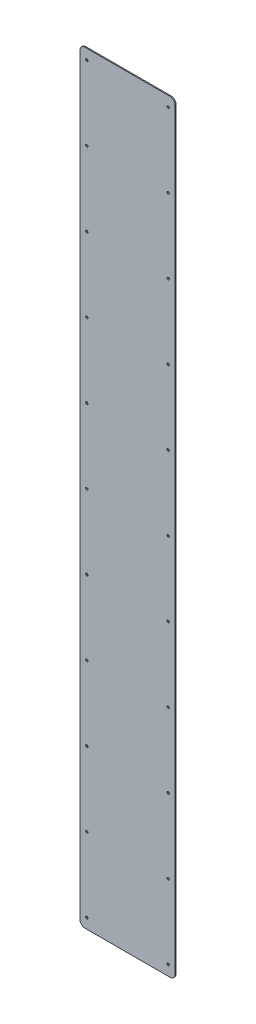
ISO-10303-21;
HEADER;
FILE_DESCRIPTION(('STEP AP214'),'2;1');
FILE_NAME('part.step','',(''),(''),'','','');
FILE_SCHEMA(('AUTOMOTIVE_DESIGN { 1 0 10303 214 1 1 1 1 }'));
ENDSEC;
DATA;
#1=APPLICATION_CONTEXT('core data for automotive mechanical design processes');
#2=APPLICATION_PROTOCOL_DEFINITION('international standard','automotive_design',2000,#1);
#3=PRODUCT_CONTEXT('',#1,'mechanical');
#4=PRODUCT('Part','Part','',(#3));
#5=PRODUCT_RELATED_PRODUCT_CATEGORY('part','',(#4));
#6=PRODUCT_DEFINITION_FORMATION('','',#4);
#7=PRODUCT_DEFINITION_CONTEXT('part definition',#1,'design');
#8=PRODUCT_DEFINITION('design','',#6,#7);
#9=PRODUCT_DEFINITION_SHAPE('','',#8);
#10=(LENGTH_UNIT() NAMED_UNIT(*) SI_UNIT(.MILLI.,.METRE.));
#11=(NAMED_UNIT(*) PLANE_ANGLE_UNIT() SI_UNIT($,.RADIAN.));
#12=(NAMED_UNIT(*) SI_UNIT($,.STERADIAN.) SOLID_ANGLE_UNIT());
#13=UNCERTAINTY_MEASURE_WITH_UNIT(LENGTH_MEASURE(1.E-05),#10,'distance_accuracy_value','');
#14=(GEOMETRIC_REPRESENTATION_CONTEXT(3) GLOBAL_UNCERTAINTY_ASSIGNED_CONTEXT((#13)) GLOBAL_UNIT_ASSIGNED_CONTEXT((#10,
#11,#12)) REPRESENTATION_CONTEXT('',''));
#15=CARTESIAN_POINT('',(0.,0.,0.));
#16=DIRECTION('',(0.,0.,1.));
#17=DIRECTION('',(1.,0.,0.));
#18=AXIS2_PLACEMENT_3D('',#15,#16,#17);
#19=CARTESIAN_POINT('',(10.,10.,-2.));
#20=DIRECTION('',(0.,0.,1.));
#21=DIRECTION('',(1.,0.,0.));
#22=AXIS2_PLACEMENT_3D('',#19,#20,#21);
#23=CYLINDRICAL_SURFACE('',#22,10.);
#24=CARTESIAN_POINT('',(10.,10.,0.));
#25=DIRECTION('',(0.,0.,1.));
#26=DIRECTION('',(1.,0.,0.));
#27=AXIS2_PLACEMENT_3D('',#24,#25,#26);
#28=CIRCLE('',#27,10.);
#29=CARTESIAN_POINT('',(0.,10.0000000000001,0.));
#30=VERTEX_POINT('',#29);
#31=CARTESIAN_POINT('',(10.0000000000001,0.,0.));
#32=VERTEX_POINT('',#31);
#33=EDGE_CURVE('E133',#30,#32,#28,.T.);
#34=ORIENTED_EDGE('',*,*,#33,.F.);
#35=DIRECTION('',(0.,0.,1.));
#36=VECTOR('',#35,1.);
#37=CARTESIAN_POINT('',(0.,10.0000000000001,-2.));
#38=LINE('',#37,#36);
#39=CARTESIAN_POINT('',(0.,10.0000000000001,-2.));
#40=VERTEX_POINT('',#39);
#41=EDGE_CURVE('E11',#40,#30,#38,.T.);
#42=ORIENTED_EDGE('',*,*,#41,.F.);
#43=CARTESIAN_POINT('',(10.,10.,-2.));
#44=DIRECTION('',(0.,0.,1.));
#45=DIRECTION('',(1.,0.,0.));
#46=AXIS2_PLACEMENT_3D('',#43,#44,#45);
#47=CIRCLE('',#46,10.);
#48=CARTESIAN_POINT('',(10.0000000000001,0.,-2.));
#49=VERTEX_POINT('',#48);
#50=EDGE_CURVE('E154',#40,#49,#47,.T.);
#51=ORIENTED_EDGE('',*,*,#50,.T.);
#52=DIRECTION('',(0.,0.,1.));
#53=VECTOR('',#52,1.);
#54=CARTESIAN_POINT('',(10.0000000000001,0.,-2.));
#55=LINE('',#54,#53);
#56=EDGE_CURVE('E39',#49,#32,#55,.T.);
#57=ORIENTED_EDGE('',*,*,#56,.T.);
#58=EDGE_LOOP('',(#34,#42,#51,#57));
#59=FACE_BOUND('',#58,.T.);
#60=ADVANCED_FACE('F36',(#59),#23,.T.);
#61=CARTESIAN_POINT('',(0.,10.0000000000001,-2.));
#62=DIRECTION('',(-1.,0.,0.));
#63=DIRECTION('',(0.,0.,1.));
#64=AXIS2_PLACEMENT_3D('',#61,#62,#63);
#65=PLANE('',#64);
#66=DIRECTION('',(0.,-1.,0.));
#67=VECTOR('',#66,1.);
#68=CARTESIAN_POINT('',(0.,10.0000000000001,0.));
#69=LINE('',#68,#67);
#70=CARTESIAN_POINT('',(0.,1490.,0.));
#71=VERTEX_POINT('',#70);
#72=EDGE_CURVE('E152',#71,#30,#69,.T.);
#73=ORIENTED_EDGE('',*,*,#72,.F.);
#74=DIRECTION('',(0.,0.,1.));
#75=VECTOR('',#74,1.);
#76=CARTESIAN_POINT('',(0.,1490.,-2.));
#77=LINE('',#76,#75);
#78=CARTESIAN_POINT('',(0.,1490.,-2.));
#79=VERTEX_POINT('',#78);
#80=EDGE_CURVE('E45',#79,#71,#77,.T.);
#81=ORIENTED_EDGE('',*,*,#80,.F.);
#82=DIRECTION('',(0.,-1.,0.));
#83=VECTOR('',#82,1.);
#84=CARTESIAN_POINT('',(0.,10.0000000000001,-2.));
#85=LINE('',#84,#83);
#86=EDGE_CURVE('E123',#79,#40,#85,.T.);
#87=ORIENTED_EDGE('',*,*,#86,.T.);
#88=ORIENTED_EDGE('',*,*,#41,.T.);
#89=EDGE_LOOP('',(#73,#81,#87,#88));
#90=FACE_BOUND('',#89,.T.);
#91=ADVANCED_FACE('F166',(#90),#65,.T.);
#92=CARTESIAN_POINT('',(10.,1490.,-2.));
#93=DIRECTION('',(0.,0.,1.));
#94=DIRECTION('',(1.,0.,0.));
#95=AXIS2_PLACEMENT_3D('',#92,#93,#94);
#96=CYLINDRICAL_SURFACE('',#95,10.);
#97=CARTESIAN_POINT('',(10.,1490.,0.));
#98=DIRECTION('',(0.,0.,1.));
#99=DIRECTION('',(-1.,0.,0.));
#100=AXIS2_PLACEMENT_3D('',#97,#98,#99);
#101=CIRCLE('',#100,10.);
#102=CARTESIAN_POINT('',(10.0000000000001,1500.,0.));
#103=VERTEX_POINT('',#102);
#104=EDGE_CURVE('E110',#103,#71,#101,.T.);
#105=ORIENTED_EDGE('',*,*,#104,.F.);
#106=DIRECTION('',(0.,0.,1.));
#107=VECTOR('',#106,1.);
#108=CARTESIAN_POINT('',(10.0000000000001,1500.,-2.));
#109=LINE('',#108,#107);
#110=CARTESIAN_POINT('',(10.0000000000001,1500.,-2.));
#111=VERTEX_POINT('',#110);
#112=EDGE_CURVE('E105',#111,#103,#109,.T.);
#113=ORIENTED_EDGE('',*,*,#112,.F.);
#114=CARTESIAN_POINT('',(10.,1490.,-2.));
#115=DIRECTION('',(0.,0.,1.));
#116=DIRECTION('',(-1.,0.,0.));
#117=AXIS2_PLACEMENT_3D('',#114,#115,#116);
#118=CIRCLE('',#117,10.);
#119=EDGE_CURVE('E108',#111,#79,#118,.T.);
#120=ORIENTED_EDGE('',*,*,#119,.T.);
#121=ORIENTED_EDGE('',*,*,#80,.T.);
#122=EDGE_LOOP('',(#105,#113,#120,#121));
#123=FACE_BOUND('',#122,.T.);
#124=ADVANCED_FACE('F107',(#123),#96,.T.);
#125=CARTESIAN_POINT('',(10.0000000000001,1500.,-2.));
#126=DIRECTION('',(0.,1.,0.));
#127=DIRECTION('',(0.,0.,1.));
#128=AXIS2_PLACEMENT_3D('',#125,#126,#127);
#129=PLANE('',#128);
#130=DIRECTION('',(-1.,0.,0.));
#131=VECTOR('',#130,1.);
#132=CARTESIAN_POINT('',(10.0000000000001,1500.,0.));
#133=LINE('',#132,#131);
#134=CARTESIAN_POINT('',(177.2,1500.,0.));
#135=VERTEX_POINT('',#134);
#136=EDGE_CURVE('E149',#135,#103,#133,.T.);
#137=ORIENTED_EDGE('',*,*,#136,.F.);
#138=DIRECTION('',(0.,0.,1.));
#139=VECTOR('',#138,1.);
#140=CARTESIAN_POINT('',(177.2,1500.,-2.));
#141=LINE('',#140,#139);
#142=CARTESIAN_POINT('',(177.2,1500.,-2.));
#143=VERTEX_POINT('',#142);
#144=EDGE_CURVE('E115',#143,#135,#141,.T.);
#145=ORIENTED_EDGE('',*,*,#144,.F.);
#146=DIRECTION('',(-1.,0.,0.));
#147=VECTOR('',#146,1.);
#148=CARTESIAN_POINT('',(10.0000000000001,1500.,-2.));
#149=LINE('',#148,#147);
#150=EDGE_CURVE('E121',#143,#111,#149,.T.);
#151=ORIENTED_EDGE('',*,*,#150,.T.);
#152=ORIENTED_EDGE('',*,*,#112,.T.);
#153=EDGE_LOOP('',(#137,#145,#151,#152));
#154=FACE_BOUND('',#153,.T.);
#155=ADVANCED_FACE('F125',(#154),#129,.T.);
#156=CARTESIAN_POINT('',(177.2,1490.,-2.));
#157=DIRECTION('',(0.,0.,1.));
#158=DIRECTION('',(1.,0.,0.));
#159=AXIS2_PLACEMENT_3D('',#156,#157,#158);
#160=CYLINDRICAL_SURFACE('',#159,10.);
#161=CARTESIAN_POINT('',(177.2,1490.,0.));
#162=DIRECTION('',(0.,0.,1.));
#163=DIRECTION('',(-1.,0.,0.));
#164=AXIS2_PLACEMENT_3D('',#161,#162,#163);
#165=CIRCLE('',#164,10.);
#166=CARTESIAN_POINT('',(187.2,1490.,0.));
#167=VERTEX_POINT('',#166);
#168=EDGE_CURVE('E146',#167,#135,#165,.T.);
#169=ORIENTED_EDGE('',*,*,#168,.F.);
#170=DIRECTION('',(0.,0.,1.));
#171=VECTOR('',#170,1.);
#172=CARTESIAN_POINT('',(187.2,1490.,-2.));
#173=LINE('',#172,#171);
#174=CARTESIAN_POINT('',(187.2,1490.,-2.));
#175=VERTEX_POINT('',#174);
#176=EDGE_CURVE('E158',#175,#167,#173,.T.);
#177=ORIENTED_EDGE('',*,*,#176,.F.);
#178=CARTESIAN_POINT('',(177.2,1490.,-2.));
#179=DIRECTION('',(0.,0.,1.));
#180=DIRECTION('',(-1.,0.,0.));
#181=AXIS2_PLACEMENT_3D('',#178,#179,#180);
#182=CIRCLE('',#181,10.);
#183=EDGE_CURVE('E126',#175,#143,#182,.T.);
#184=ORIENTED_EDGE('',*,*,#183,.T.);
#185=ORIENTED_EDGE('',*,*,#144,.T.);
#186=EDGE_LOOP('',(#169,#177,#184,#185));
#187=FACE_BOUND('',#186,.T.);
#188=ADVANCED_FACE('F179',(#187),#160,.T.);
#189=CARTESIAN_POINT('',(187.2,10.0000000000001,-2.));
#190=DIRECTION('',(1.,0.,0.));
#191=DIRECTION('',(0.,0.,-1.));
#192=AXIS2_PLACEMENT_3D('',#189,#190,#191);
#193=PLANE('',#192);
#194=DIRECTION('',(0.,1.,0.));
#195=VECTOR('',#194,1.);
#196=CARTESIAN_POINT('',(187.2,10.0000000000001,0.));
#197=LINE('',#196,#195);
#198=CARTESIAN_POINT('',(187.2,10.0000000000001,0.));
#199=VERTEX_POINT('',#198);
#200=EDGE_CURVE('E143',#199,#167,#197,.T.);
#201=ORIENTED_EDGE('',*,*,#200,.F.);
#202=DIRECTION('',(0.,0.,1.));
#203=VECTOR('',#202,1.);
#204=CARTESIAN_POINT('',(187.2,10.0000000000001,-2.));
#205=LINE('',#204,#203);
#206=CARTESIAN_POINT('',(187.2,10.0000000000001,-2.));
#207=VERTEX_POINT('',#206);
#208=EDGE_CURVE('E160',#207,#199,#205,.T.);
#209=ORIENTED_EDGE('',*,*,#208,.F.);
#210=DIRECTION('',(0.,1.,0.));
#211=VECTOR('',#210,1.);
#212=CARTESIAN_POINT('',(187.2,10.0000000000001,-2.));
#213=LINE('',#212,#211);
#214=EDGE_CURVE('E128',#207,#175,#213,.T.);
#215=ORIENTED_EDGE('',*,*,#214,.T.);
#216=ORIENTED_EDGE('',*,*,#176,.T.);
#217=EDGE_LOOP('',(#201,#209,#215,#216));
#218=FACE_BOUND('',#217,.T.);
#219=ADVANCED_FACE('F182',(#218),#193,.T.);
#220=CARTESIAN_POINT('',(177.2,10.,-2.));
#221=DIRECTION('',(0.,0.,1.));
#222=DIRECTION('',(1.,0.,0.));
#223=AXIS2_PLACEMENT_3D('',#220,#221,#222);
#224=CYLINDRICAL_SURFACE('',#223,10.);
#225=CARTESIAN_POINT('',(177.2,10.,0.));
#226=DIRECTION('',(0.,0.,1.));
#227=DIRECTION('',(-1.,0.,0.));
#228=AXIS2_PLACEMENT_3D('',#225,#226,#227);
#229=CIRCLE('',#228,10.);
#230=CARTESIAN_POINT('',(177.2,0.,0.));
#231=VERTEX_POINT('',#230);
#232=EDGE_CURVE('E140',#231,#199,#229,.T.);
#233=ORIENTED_EDGE('',*,*,#232,.F.);
#234=DIRECTION('',(0.,0.,1.));
#235=VECTOR('',#234,1.);
#236=CARTESIAN_POINT('',(177.2,0.,-2.));
#237=LINE('',#236,#235);
#238=CARTESIAN_POINT('',(177.2,0.,-2.));
#239=VERTEX_POINT('',#238);
#240=EDGE_CURVE('E161',#239,#231,#237,.T.);
#241=ORIENTED_EDGE('',*,*,#240,.F.);
#242=CARTESIAN_POINT('',(177.2,10.,-2.));
#243=DIRECTION('',(0.,0.,1.));
#244=DIRECTION('',(-1.,0.,0.));
#245=AXIS2_PLACEMENT_3D('',#242,#243,#244);
#246=CIRCLE('',#245,10.);
#247=EDGE_CURVE('E428',#239,#207,#246,.T.);
#248=ORIENTED_EDGE('',*,*,#247,.T.);
#249=ORIENTED_EDGE('',*,*,#208,.T.);
#250=EDGE_LOOP('',(#233,#241,#248,#249));
#251=FACE_BOUND('',#250,.T.);
#252=ADVANCED_FACE('F186',(#251),#224,.T.);
#253=CARTESIAN_POINT('',(10.0000000000001,0.,-2.));
#254=DIRECTION('',(0.,-1.,0.));
#255=DIRECTION('',(0.,0.,-1.));
#256=AXIS2_PLACEMENT_3D('',#253,#254,#255);
#257=PLANE('',#256);
#258=DIRECTION('',(1.,0.,0.));
#259=VECTOR('',#258,1.);
#260=CARTESIAN_POINT('',(10.0000000000001,0.,0.));
#261=LINE('',#260,#259);
#262=EDGE_CURVE('E136',#32,#231,#261,.T.);
#263=ORIENTED_EDGE('',*,*,#262,.F.);
#264=ORIENTED_EDGE('',*,*,#56,.F.);
#265=DIRECTION('',(1.,0.,0.));
#266=VECTOR('',#265,1.);
#267=CARTESIAN_POINT('',(10.0000000000001,0.,-2.));
#268=LINE('',#267,#266);
#269=EDGE_CURVE('E426',#49,#239,#268,.T.);
#270=ORIENTED_EDGE('',*,*,#269,.T.);
#271=ORIENTED_EDGE('',*,*,#240,.T.);
#272=EDGE_LOOP('',(#263,#264,#270,#271));
#273=FACE_BOUND('',#272,.T.);
#274=ADVANCED_FACE('F163',(#273),#257,.T.);
#275=CARTESIAN_POINT('',(10.,10.,-2.));
#276=DIRECTION('',(0.,0.,1.));
#277=DIRECTION('',(1.,0.,0.));
#278=AXIS2_PLACEMENT_3D('',#275,#276,#277);
#279=PLANE('',#278);
#280=CARTESIAN_POINT('',(13.6000000000002,20.0000000000009,-2.));
#281=DIRECTION('',(0.,0.,1.));
#282=DIRECTION('',(1.,0.,0.));
#283=AXIS2_PLACEMENT_3D('',#280,#281,#282);
#284=CIRCLE('',#283,2.25000000000005);
#285=CARTESIAN_POINT('',(15.8500000000002,20.0000000000009,-2.));
#286=VERTEX_POINT('',#285);
#287=EDGE_CURVE('E293',#286,#286,#284,.T.);
#288=ORIENTED_EDGE('',*,*,#287,.T.);
#289=EDGE_LOOP('',(#288));
#290=FACE_BOUND('',#289,.T.);
#291=CARTESIAN_POINT('',(13.6000000000002,166.000000000001,-2.));
#292=DIRECTION('',(0.,0.,1.));
#293=DIRECTION('',(1.,0.,0.));
#294=AXIS2_PLACEMENT_3D('',#291,#292,#293);
#295=CIRCLE('',#294,2.25000000000004);
#296=CARTESIAN_POINT('',(15.8500000000002,166.000000000001,-2.));
#297=VERTEX_POINT('',#296);
#298=EDGE_CURVE('E301',#297,#297,#295,.T.);
#299=ORIENTED_EDGE('',*,*,#298,.T.);
#300=EDGE_LOOP('',(#299));
#301=FACE_BOUND('',#300,.T.);
#302=CARTESIAN_POINT('',(13.6000000000001,312.000000000001,-2.));
#303=DIRECTION('',(0.,0.,1.));
#304=DIRECTION('',(1.,0.,0.));
#305=AXIS2_PLACEMENT_3D('',#302,#303,#304);
#306=CIRCLE('',#305,2.25000000000004);
#307=CARTESIAN_POINT('',(15.8500000000002,312.000000000001,-2.));
#308=VERTEX_POINT('',#307);
#309=EDGE_CURVE('E307',#308,#308,#306,.T.);
#310=ORIENTED_EDGE('',*,*,#309,.T.);
#311=EDGE_LOOP('',(#310));
#312=FACE_BOUND('',#311,.T.);
#313=CARTESIAN_POINT('',(13.6000000000001,458.000000000001,-2.));
#314=DIRECTION('',(0.,0.,1.));
#315=DIRECTION('',(1.,0.,0.));
#316=AXIS2_PLACEMENT_3D('',#313,#314,#315);
#317=CIRCLE('',#316,2.25000000000005);
#318=CARTESIAN_POINT('',(15.8500000000002,458.000000000001,-2.));
#319=VERTEX_POINT('',#318);
#320=EDGE_CURVE('E313',#319,#319,#317,.T.);
#321=ORIENTED_EDGE('',*,*,#320,.T.);
#322=EDGE_LOOP('',(#321));
#323=FACE_BOUND('',#322,.T.);
#324=CARTESIAN_POINT('',(13.6000000000001,604.000000000001,-2.));
#325=DIRECTION('',(0.,0.,1.));
#326=DIRECTION('',(1.,0.,0.));
#327=AXIS2_PLACEMENT_3D('',#324,#325,#326);
#328=CIRCLE('',#327,2.25000000000006);
#329=CARTESIAN_POINT('',(15.8500000000002,604.000000000001,-2.));
#330=VERTEX_POINT('',#329);
#331=EDGE_CURVE('E319',#330,#330,#328,.T.);
#332=ORIENTED_EDGE('',*,*,#331,.T.);
#333=EDGE_LOOP('',(#332));
#334=FACE_BOUND('',#333,.T.);
#335=CARTESIAN_POINT('',(13.6000000000001,750.,-2.));
#336=DIRECTION('',(0.,0.,1.));
#337=DIRECTION('',(1.,0.,0.));
#338=AXIS2_PLACEMENT_3D('',#335,#336,#337);
#339=CIRCLE('',#338,2.25000000000006);
#340=CARTESIAN_POINT('',(15.8500000000002,750.,-2.));
#341=VERTEX_POINT('',#340);
#342=EDGE_CURVE('E325',#341,#341,#339,.T.);
#343=ORIENTED_EDGE('',*,*,#342,.T.);
#344=EDGE_LOOP('',(#343));
#345=FACE_BOUND('',#344,.T.);
#346=CARTESIAN_POINT('',(13.6000000000001,896.,-2.));
#347=DIRECTION('',(0.,0.,1.));
#348=DIRECTION('',(1.,0.,0.));
#349=AXIS2_PLACEMENT_3D('',#346,#347,#348);
#350=CIRCLE('',#349,2.25000000000006);
#351=CARTESIAN_POINT('',(15.8500000000001,896.,-2.));
#352=VERTEX_POINT('',#351);
#353=EDGE_CURVE('E331',#352,#352,#350,.T.);
#354=ORIENTED_EDGE('',*,*,#353,.T.);
#355=EDGE_LOOP('',(#354));
#356=FACE_BOUND('',#355,.T.);
#357=CARTESIAN_POINT('',(13.6000000000001,1042.,-2.));
#358=DIRECTION('',(0.,0.,1.));
#359=DIRECTION('',(1.,0.,0.));
#360=AXIS2_PLACEMENT_3D('',#357,#358,#359);
#361=CIRCLE('',#360,2.25000000000006);
#362=CARTESIAN_POINT('',(15.8500000000001,1042.,-2.));
#363=VERTEX_POINT('',#362);
#364=EDGE_CURVE('E337',#363,#363,#361,.T.);
#365=ORIENTED_EDGE('',*,*,#364,.T.);
#366=EDGE_LOOP('',(#365));
#367=FACE_BOUND('',#366,.T.);
#368=CARTESIAN_POINT('',(13.6,1188.,-2.));
#369=DIRECTION('',(0.,0.,1.));
#370=DIRECTION('',(1.,0.,0.));
#371=AXIS2_PLACEMENT_3D('',#368,#369,#370);
#372=CIRCLE('',#371,2.25000000000006);
#373=CARTESIAN_POINT('',(15.8500000000001,1188.,-2.));
#374=VERTEX_POINT('',#373);
#375=EDGE_CURVE('E343',#374,#374,#372,.T.);
#376=ORIENTED_EDGE('',*,*,#375,.T.);
#377=EDGE_LOOP('',(#376));
#378=FACE_BOUND('',#377,.T.);
#379=CARTESIAN_POINT('',(13.6,1334.,-2.));
#380=DIRECTION('',(0.,0.,1.));
#381=DIRECTION('',(1.,0.,0.));
#382=AXIS2_PLACEMENT_3D('',#379,#380,#381);
#383=CIRCLE('',#382,2.25000000000006);
#384=CARTESIAN_POINT('',(15.8500000000001,1334.,-2.));
#385=VERTEX_POINT('',#384);
#386=EDGE_CURVE('E349',#385,#385,#383,.T.);
#387=ORIENTED_EDGE('',*,*,#386,.T.);
#388=EDGE_LOOP('',(#387));
#389=FACE_BOUND('',#388,.T.);
#390=CARTESIAN_POINT('',(173.6,20.0000000000009,-2.));
#391=DIRECTION('',(0.,0.,1.));
#392=DIRECTION('',(1.,0.,0.));
#393=AXIS2_PLACEMENT_3D('',#390,#391,#392);
#394=CIRCLE('',#393,2.25000000000007);
#395=CARTESIAN_POINT('',(175.85,20.0000000000009,-2.));
#396=VERTEX_POINT('',#395);
#397=EDGE_CURVE('E355',#396,#396,#394,.T.);
#398=ORIENTED_EDGE('',*,*,#397,.T.);
#399=EDGE_LOOP('',(#398));
#400=FACE_BOUND('',#399,.T.);
#401=CARTESIAN_POINT('',(173.6,166.000000000001,-2.));
#402=DIRECTION('',(0.,0.,1.));
#403=DIRECTION('',(1.,0.,0.));
#404=AXIS2_PLACEMENT_3D('',#401,#402,#403);
#405=CIRCLE('',#404,2.25000000000007);
#406=CARTESIAN_POINT('',(175.85,166.000000000001,-2.));
#407=VERTEX_POINT('',#406);
#408=EDGE_CURVE('E361',#407,#407,#405,.T.);
#409=ORIENTED_EDGE('',*,*,#408,.T.);
#410=EDGE_LOOP('',(#409));
#411=FACE_BOUND('',#410,.T.);
#412=CARTESIAN_POINT('',(173.6,312.000000000001,-2.));
#413=DIRECTION('',(0.,0.,1.));
#414=DIRECTION('',(1.,0.,0.));
#415=AXIS2_PLACEMENT_3D('',#412,#413,#414);
#416=CIRCLE('',#415,2.25000000000006);
#417=CARTESIAN_POINT('',(175.85,312.000000000001,-2.));
#418=VERTEX_POINT('',#417);
#419=EDGE_CURVE('E367',#418,#418,#416,.T.);
#420=ORIENTED_EDGE('',*,*,#419,.T.);
#421=EDGE_LOOP('',(#420));
#422=FACE_BOUND('',#421,.T.);
#423=CARTESIAN_POINT('',(173.6,458.000000000001,-2.));
#424=DIRECTION('',(0.,0.,1.));
#425=DIRECTION('',(1.,0.,0.));
#426=AXIS2_PLACEMENT_3D('',#423,#424,#425);
#427=CIRCLE('',#426,2.25000000000006);
#428=CARTESIAN_POINT('',(175.85,458.000000000001,-2.));
#429=VERTEX_POINT('',#428);
#430=EDGE_CURVE('E373',#429,#429,#427,.T.);
#431=ORIENTED_EDGE('',*,*,#430,.T.);
#432=EDGE_LOOP('',(#431));
#433=FACE_BOUND('',#432,.T.);
#434=CARTESIAN_POINT('',(173.6,604.000000000001,-2.));
#435=DIRECTION('',(0.,0.,1.));
#436=DIRECTION('',(1.,0.,0.));
#437=AXIS2_PLACEMENT_3D('',#434,#435,#436);
#438=CIRCLE('',#437,2.25000000000011);
#439=CARTESIAN_POINT('',(175.85,604.000000000001,-2.));
#440=VERTEX_POINT('',#439);
#441=EDGE_CURVE('E379',#440,#440,#438,.T.);
#442=ORIENTED_EDGE('',*,*,#441,.T.);
#443=EDGE_LOOP('',(#442));
#444=FACE_BOUND('',#443,.T.);
#445=CARTESIAN_POINT('',(173.6,750.,-2.));
#446=DIRECTION('',(0.,0.,1.));
#447=DIRECTION('',(1.,0.,0.));
#448=AXIS2_PLACEMENT_3D('',#445,#446,#447);
#449=CIRCLE('',#448,2.25000000000011);
#450=CARTESIAN_POINT('',(175.85,750.,-2.));
#451=VERTEX_POINT('',#450);
#452=EDGE_CURVE('E385',#451,#451,#449,.T.);
#453=ORIENTED_EDGE('',*,*,#452,.T.);
#454=EDGE_LOOP('',(#453));
#455=FACE_BOUND('',#454,.T.);
#456=CARTESIAN_POINT('',(173.6,896.,-2.));
#457=DIRECTION('',(0.,0.,1.));
#458=DIRECTION('',(1.,0.,0.));
#459=AXIS2_PLACEMENT_3D('',#456,#457,#458);
#460=CIRCLE('',#459,2.25000000000011);
#461=CARTESIAN_POINT('',(175.85,896.,-2.));
#462=VERTEX_POINT('',#461);
#463=EDGE_CURVE('E391',#462,#462,#460,.T.);
#464=ORIENTED_EDGE('',*,*,#463,.T.);
#465=EDGE_LOOP('',(#464));
#466=FACE_BOUND('',#465,.T.);
#467=CARTESIAN_POINT('',(173.6,1042.,-2.));
#468=DIRECTION('',(0.,0.,1.));
#469=DIRECTION('',(1.,0.,0.));
#470=AXIS2_PLACEMENT_3D('',#467,#468,#469);
#471=CIRCLE('',#470,2.25000000000011);
#472=CARTESIAN_POINT('',(175.85,1042.,-2.));
#473=VERTEX_POINT('',#472);
#474=EDGE_CURVE('E397',#473,#473,#471,.T.);
#475=ORIENTED_EDGE('',*,*,#474,.T.);
#476=EDGE_LOOP('',(#475));
#477=FACE_BOUND('',#476,.T.);
#478=CARTESIAN_POINT('',(173.6,1188.,-2.));
#479=DIRECTION('',(0.,0.,1.));
#480=DIRECTION('',(1.,0.,0.));
#481=AXIS2_PLACEMENT_3D('',#478,#479,#480);
#482=CIRCLE('',#481,2.25000000000011);
#483=CARTESIAN_POINT('',(175.85,1188.,-2.));
#484=VERTEX_POINT('',#483);
#485=EDGE_CURVE('E403',#484,#484,#482,.T.);
#486=ORIENTED_EDGE('',*,*,#485,.T.);
#487=EDGE_LOOP('',(#486));
#488=FACE_BOUND('',#487,.T.);
#489=CARTESIAN_POINT('',(173.6,1334.,-2.));
#490=DIRECTION('',(0.,0.,1.));
#491=DIRECTION('',(1.,0.,0.));
#492=AXIS2_PLACEMENT_3D('',#489,#490,#491);
#493=CIRCLE('',#492,2.25000000000011);
#494=CARTESIAN_POINT('',(175.85,1334.,-2.));
#495=VERTEX_POINT('',#494);
#496=EDGE_CURVE('E409',#495,#495,#493,.T.);
#497=ORIENTED_EDGE('',*,*,#496,.T.);
#498=EDGE_LOOP('',(#497));
#499=FACE_BOUND('',#498,.T.);
#500=CARTESIAN_POINT('',(173.6,1480.,-2.));
#501=DIRECTION('',(0.,0.,1.));
#502=DIRECTION('',(1.,0.,0.));
#503=AXIS2_PLACEMENT_3D('',#500,#501,#502);
#504=CIRCLE('',#503,2.25000000000011);
#505=CARTESIAN_POINT('',(175.85,1480.,-2.));
#506=VERTEX_POINT('',#505);
#507=EDGE_CURVE('E415',#506,#506,#504,.T.);
#508=ORIENTED_EDGE('',*,*,#507,.T.);
#509=EDGE_LOOP('',(#508));
#510=FACE_BOUND('',#509,.T.);
#511=CARTESIAN_POINT('',(13.6,1480.,-2.));
#512=DIRECTION('',(0.,0.,1.));
#513=DIRECTION('',(1.,0.,0.));
#514=AXIS2_PLACEMENT_3D('',#511,#512,#513);
#515=CIRCLE('',#514,2.25000000000006);
#516=CARTESIAN_POINT('',(15.8500000000001,1480.,-2.));
#517=VERTEX_POINT('',#516);
#518=EDGE_CURVE('E137',#517,#517,#515,.T.);
#519=ORIENTED_EDGE('',*,*,#518,.T.);
#520=EDGE_LOOP('',(#519));
#521=FACE_BOUND('',#520,.T.);
#522=ORIENTED_EDGE('',*,*,#50,.F.);
#523=ORIENTED_EDGE('',*,*,#86,.F.);
#524=ORIENTED_EDGE('',*,*,#119,.F.);
#525=ORIENTED_EDGE('',*,*,#150,.F.);
#526=ORIENTED_EDGE('',*,*,#183,.F.);
#527=ORIENTED_EDGE('',*,*,#214,.F.);
#528=ORIENTED_EDGE('',*,*,#247,.F.);
#529=ORIENTED_EDGE('',*,*,#269,.F.);
#530=EDGE_LOOP('',(#522,#523,#524,#525,#526,#527,#528,#529));
#531=FACE_BOUND('',#530,.T.);
#532=ADVANCED_FACE('F119',(#290,#301,#312,#323,#334,#345,#356,#367,#378,#389,#400,#411,#422,
#433,#444,#455,#466,#477,#488,#499,#510,#521,#531),#279,.F.);
#533=CARTESIAN_POINT('',(10.,10.,0.));
#534=DIRECTION('',(0.,0.,1.));
#535=DIRECTION('',(1.,0.,0.));
#536=AXIS2_PLACEMENT_3D('',#533,#534,#535);
#537=PLANE('',#536);
#538=CARTESIAN_POINT('',(13.6000000000002,20.0000000000009,0.));
#539=DIRECTION('',(0.,0.,1.));
#540=DIRECTION('',(1.,0.,0.));
#541=AXIS2_PLACEMENT_3D('',#538,#539,#540);
#542=CIRCLE('',#541,2.25000000000005);
#543=CARTESIAN_POINT('',(15.8500000000002,20.0000000000009,0.));
#544=VERTEX_POINT('',#543);
#545=EDGE_CURVE('E296',#544,#544,#542,.T.);
#546=ORIENTED_EDGE('',*,*,#545,.F.);
#547=EDGE_LOOP('',(#546));
#548=FACE_BOUND('',#547,.T.);
#549=CARTESIAN_POINT('',(13.6000000000002,166.000000000001,0.));
#550=DIRECTION('',(0.,0.,1.));
#551=DIRECTION('',(1.,0.,0.));
#552=AXIS2_PLACEMENT_3D('',#549,#550,#551);
#553=CIRCLE('',#552,2.25000000000004);
#554=CARTESIAN_POINT('',(15.8500000000002,166.000000000001,0.));
#555=VERTEX_POINT('',#554);
#556=EDGE_CURVE('E298',#555,#555,#553,.T.);
#557=ORIENTED_EDGE('',*,*,#556,.F.);
#558=EDGE_LOOP('',(#557));
#559=FACE_BOUND('',#558,.T.);
#560=CARTESIAN_POINT('',(13.6000000000001,312.000000000001,0.));
#561=DIRECTION('',(0.,0.,1.));
#562=DIRECTION('',(1.,0.,0.));
#563=AXIS2_PLACEMENT_3D('',#560,#561,#562);
#564=CIRCLE('',#563,2.25000000000004);
#565=CARTESIAN_POINT('',(15.8500000000002,312.000000000001,0.));
#566=VERTEX_POINT('',#565);
#567=EDGE_CURVE('E304',#566,#566,#564,.T.);
#568=ORIENTED_EDGE('',*,*,#567,.F.);
#569=EDGE_LOOP('',(#568));
#570=FACE_BOUND('',#569,.T.);
#571=CARTESIAN_POINT('',(13.6000000000001,458.000000000001,0.));
#572=DIRECTION('',(0.,0.,1.));
#573=DIRECTION('',(1.,0.,0.));
#574=AXIS2_PLACEMENT_3D('',#571,#572,#573);
#575=CIRCLE('',#574,2.25000000000005);
#576=CARTESIAN_POINT('',(15.8500000000002,458.000000000001,0.));
#577=VERTEX_POINT('',#576);
#578=EDGE_CURVE('E310',#577,#577,#575,.T.);
#579=ORIENTED_EDGE('',*,*,#578,.F.);
#580=EDGE_LOOP('',(#579));
#581=FACE_BOUND('',#580,.T.);
#582=CARTESIAN_POINT('',(13.6000000000001,604.000000000001,0.));
#583=DIRECTION('',(0.,0.,1.));
#584=DIRECTION('',(1.,0.,0.));
#585=AXIS2_PLACEMENT_3D('',#582,#583,#584);
#586=CIRCLE('',#585,2.25000000000006);
#587=CARTESIAN_POINT('',(15.8500000000002,604.000000000001,0.));
#588=VERTEX_POINT('',#587);
#589=EDGE_CURVE('E316',#588,#588,#586,.T.);
#590=ORIENTED_EDGE('',*,*,#589,.F.);
#591=EDGE_LOOP('',(#590));
#592=FACE_BOUND('',#591,.T.);
#593=CARTESIAN_POINT('',(13.6000000000001,750.,0.));
#594=DIRECTION('',(0.,0.,1.));
#595=DIRECTION('',(1.,0.,0.));
#596=AXIS2_PLACEMENT_3D('',#593,#594,#595);
#597=CIRCLE('',#596,2.25000000000006);
#598=CARTESIAN_POINT('',(15.8500000000002,750.,0.));
#599=VERTEX_POINT('',#598);
#600=EDGE_CURVE('E322',#599,#599,#597,.T.);
#601=ORIENTED_EDGE('',*,*,#600,.F.);
#602=EDGE_LOOP('',(#601));
#603=FACE_BOUND('',#602,.T.);
#604=CARTESIAN_POINT('',(13.6000000000001,896.,0.));
#605=DIRECTION('',(0.,0.,1.));
#606=DIRECTION('',(1.,0.,0.));
#607=AXIS2_PLACEMENT_3D('',#604,#605,#606);
#608=CIRCLE('',#607,2.25000000000006);
#609=CARTESIAN_POINT('',(15.8500000000001,896.,0.));
#610=VERTEX_POINT('',#609);
#611=EDGE_CURVE('E328',#610,#610,#608,.T.);
#612=ORIENTED_EDGE('',*,*,#611,.F.);
#613=EDGE_LOOP('',(#612));
#614=FACE_BOUND('',#613,.T.);
#615=CARTESIAN_POINT('',(13.6000000000001,1042.,0.));
#616=DIRECTION('',(0.,0.,1.));
#617=DIRECTION('',(1.,0.,0.));
#618=AXIS2_PLACEMENT_3D('',#615,#616,#617);
#619=CIRCLE('',#618,2.25000000000006);
#620=CARTESIAN_POINT('',(15.8500000000001,1042.,0.));
#621=VERTEX_POINT('',#620);
#622=EDGE_CURVE('E334',#621,#621,#619,.T.);
#623=ORIENTED_EDGE('',*,*,#622,.F.);
#624=EDGE_LOOP('',(#623));
#625=FACE_BOUND('',#624,.T.);
#626=CARTESIAN_POINT('',(13.6,1188.,0.));
#627=DIRECTION('',(0.,0.,1.));
#628=DIRECTION('',(1.,0.,0.));
#629=AXIS2_PLACEMENT_3D('',#626,#627,#628);
#630=CIRCLE('',#629,2.25000000000006);
#631=CARTESIAN_POINT('',(15.8500000000001,1188.,0.));
#632=VERTEX_POINT('',#631);
#633=EDGE_CURVE('E340',#632,#632,#630,.T.);
#634=ORIENTED_EDGE('',*,*,#633,.F.);
#635=EDGE_LOOP('',(#634));
#636=FACE_BOUND('',#635,.T.);
#637=CARTESIAN_POINT('',(13.6,1334.,0.));
#638=DIRECTION('',(0.,0.,1.));
#639=DIRECTION('',(1.,0.,0.));
#640=AXIS2_PLACEMENT_3D('',#637,#638,#639);
#641=CIRCLE('',#640,2.25000000000006);
#642=CARTESIAN_POINT('',(15.8500000000001,1334.,0.));
#643=VERTEX_POINT('',#642);
#644=EDGE_CURVE('E346',#643,#643,#641,.T.);
#645=ORIENTED_EDGE('',*,*,#644,.F.);
#646=EDGE_LOOP('',(#645));
#647=FACE_BOUND('',#646,.T.);
#648=CARTESIAN_POINT('',(173.6,20.0000000000009,0.));
#649=DIRECTION('',(0.,0.,1.));
#650=DIRECTION('',(1.,0.,0.));
#651=AXIS2_PLACEMENT_3D('',#648,#649,#650);
#652=CIRCLE('',#651,2.25000000000007);
#653=CARTESIAN_POINT('',(175.85,20.0000000000009,0.));
#654=VERTEX_POINT('',#653);
#655=EDGE_CURVE('E352',#654,#654,#652,.T.);
#656=ORIENTED_EDGE('',*,*,#655,.F.);
#657=EDGE_LOOP('',(#656));
#658=FACE_BOUND('',#657,.T.);
#659=CARTESIAN_POINT('',(173.6,166.000000000001,0.));
#660=DIRECTION('',(0.,0.,1.));
#661=DIRECTION('',(1.,0.,0.));
#662=AXIS2_PLACEMENT_3D('',#659,#660,#661);
#663=CIRCLE('',#662,2.25000000000007);
#664=CARTESIAN_POINT('',(175.85,166.000000000001,0.));
#665=VERTEX_POINT('',#664);
#666=EDGE_CURVE('E358',#665,#665,#663,.T.);
#667=ORIENTED_EDGE('',*,*,#666,.F.);
#668=EDGE_LOOP('',(#667));
#669=FACE_BOUND('',#668,.T.);
#670=CARTESIAN_POINT('',(173.6,312.000000000001,0.));
#671=DIRECTION('',(0.,0.,1.));
#672=DIRECTION('',(1.,0.,0.));
#673=AXIS2_PLACEMENT_3D('',#670,#671,#672);
#674=CIRCLE('',#673,2.25000000000006);
#675=CARTESIAN_POINT('',(175.85,312.000000000001,0.));
#676=VERTEX_POINT('',#675);
#677=EDGE_CURVE('E364',#676,#676,#674,.T.);
#678=ORIENTED_EDGE('',*,*,#677,.F.);
#679=EDGE_LOOP('',(#678));
#680=FACE_BOUND('',#679,.T.);
#681=CARTESIAN_POINT('',(173.6,458.000000000001,0.));
#682=DIRECTION('',(0.,0.,1.));
#683=DIRECTION('',(1.,0.,0.));
#684=AXIS2_PLACEMENT_3D('',#681,#682,#683);
#685=CIRCLE('',#684,2.25000000000006);
#686=CARTESIAN_POINT('',(175.85,458.000000000001,0.));
#687=VERTEX_POINT('',#686);
#688=EDGE_CURVE('E370',#687,#687,#685,.T.);
#689=ORIENTED_EDGE('',*,*,#688,.F.);
#690=EDGE_LOOP('',(#689));
#691=FACE_BOUND('',#690,.T.);
#692=CARTESIAN_POINT('',(173.6,604.000000000001,0.));
#693=DIRECTION('',(0.,0.,1.));
#694=DIRECTION('',(1.,0.,0.));
#695=AXIS2_PLACEMENT_3D('',#692,#693,#694);
#696=CIRCLE('',#695,2.25000000000011);
#697=CARTESIAN_POINT('',(175.85,604.000000000001,0.));
#698=VERTEX_POINT('',#697);
#699=EDGE_CURVE('E376',#698,#698,#696,.T.);
#700=ORIENTED_EDGE('',*,*,#699,.F.);
#701=EDGE_LOOP('',(#700));
#702=FACE_BOUND('',#701,.T.);
#703=CARTESIAN_POINT('',(173.6,750.,0.));
#704=DIRECTION('',(0.,0.,1.));
#705=DIRECTION('',(1.,0.,0.));
#706=AXIS2_PLACEMENT_3D('',#703,#704,#705);
#707=CIRCLE('',#706,2.25000000000011);
#708=CARTESIAN_POINT('',(175.85,750.,0.));
#709=VERTEX_POINT('',#708);
#710=EDGE_CURVE('E382',#709,#709,#707,.T.);
#711=ORIENTED_EDGE('',*,*,#710,.F.);
#712=EDGE_LOOP('',(#711));
#713=FACE_BOUND('',#712,.T.);
#714=CARTESIAN_POINT('',(173.6,896.,0.));
#715=DIRECTION('',(0.,0.,1.));
#716=DIRECTION('',(1.,0.,0.));
#717=AXIS2_PLACEMENT_3D('',#714,#715,#716);
#718=CIRCLE('',#717,2.25000000000011);
#719=CARTESIAN_POINT('',(175.85,896.,0.));
#720=VERTEX_POINT('',#719);
#721=EDGE_CURVE('E388',#720,#720,#718,.T.);
#722=ORIENTED_EDGE('',*,*,#721,.F.);
#723=EDGE_LOOP('',(#722));
#724=FACE_BOUND('',#723,.T.);
#725=CARTESIAN_POINT('',(173.6,1042.,0.));
#726=DIRECTION('',(0.,0.,1.));
#727=DIRECTION('',(1.,0.,0.));
#728=AXIS2_PLACEMENT_3D('',#725,#726,#727);
#729=CIRCLE('',#728,2.25000000000011);
#730=CARTESIAN_POINT('',(175.85,1042.,0.));
#731=VERTEX_POINT('',#730);
#732=EDGE_CURVE('E394',#731,#731,#729,.T.);
#733=ORIENTED_EDGE('',*,*,#732,.F.);
#734=EDGE_LOOP('',(#733));
#735=FACE_BOUND('',#734,.T.);
#736=CARTESIAN_POINT('',(173.6,1188.,0.));
#737=DIRECTION('',(0.,0.,1.));
#738=DIRECTION('',(1.,0.,0.));
#739=AXIS2_PLACEMENT_3D('',#736,#737,#738);
#740=CIRCLE('',#739,2.25000000000011);
#741=CARTESIAN_POINT('',(175.85,1188.,0.));
#742=VERTEX_POINT('',#741);
#743=EDGE_CURVE('E400',#742,#742,#740,.T.);
#744=ORIENTED_EDGE('',*,*,#743,.F.);
#745=EDGE_LOOP('',(#744));
#746=FACE_BOUND('',#745,.T.);
#747=CARTESIAN_POINT('',(173.6,1334.,0.));
#748=DIRECTION('',(0.,0.,1.));
#749=DIRECTION('',(1.,0.,0.));
#750=AXIS2_PLACEMENT_3D('',#747,#748,#749);
#751=CIRCLE('',#750,2.25000000000011);
#752=CARTESIAN_POINT('',(175.85,1334.,0.));
#753=VERTEX_POINT('',#752);
#754=EDGE_CURVE('E406',#753,#753,#751,.T.);
#755=ORIENTED_EDGE('',*,*,#754,.F.);
#756=EDGE_LOOP('',(#755));
#757=FACE_BOUND('',#756,.T.);
#758=CARTESIAN_POINT('',(173.6,1480.,0.));
#759=DIRECTION('',(0.,0.,1.));
#760=DIRECTION('',(1.,0.,0.));
#761=AXIS2_PLACEMENT_3D('',#758,#759,#760);
#762=CIRCLE('',#761,2.25000000000011);
#763=CARTESIAN_POINT('',(175.85,1480.,0.));
#764=VERTEX_POINT('',#763);
#765=EDGE_CURVE('E412',#764,#764,#762,.T.);
#766=ORIENTED_EDGE('',*,*,#765,.F.);
#767=EDGE_LOOP('',(#766));
#768=FACE_BOUND('',#767,.T.);
#769=CARTESIAN_POINT('',(13.6,1480.,0.));
#770=DIRECTION('',(0.,0.,1.));
#771=DIRECTION('',(1.,0.,0.));
#772=AXIS2_PLACEMENT_3D('',#769,#770,#771);
#773=CIRCLE('',#772,2.25000000000006);
#774=CARTESIAN_POINT('',(15.8500000000001,1480.,0.));
#775=VERTEX_POINT('',#774);
#776=EDGE_CURVE('E418',#775,#775,#773,.T.);
#777=ORIENTED_EDGE('',*,*,#776,.F.);
#778=EDGE_LOOP('',(#777));
#779=FACE_BOUND('',#778,.T.);
#780=ORIENTED_EDGE('',*,*,#33,.T.);
#781=ORIENTED_EDGE('',*,*,#262,.T.);
#782=ORIENTED_EDGE('',*,*,#232,.T.);
#783=ORIENTED_EDGE('',*,*,#200,.T.);
#784=ORIENTED_EDGE('',*,*,#168,.T.);
#785=ORIENTED_EDGE('',*,*,#136,.T.);
#786=ORIENTED_EDGE('',*,*,#104,.T.);
#787=ORIENTED_EDGE('',*,*,#72,.T.);
#788=EDGE_LOOP('',(#780,#781,#782,#783,#784,#785,#786,#787));
#789=FACE_BOUND('',#788,.T.);
#790=ADVANCED_FACE('F165',(#548,#559,#570,#581,#592,#603,#614,#625,#636,#647,#658,#669,#680,
#691,#702,#713,#724,#735,#746,#757,#768,#779,#789),#537,.T.);
#791=CARTESIAN_POINT('',(13.6,1480.,-2.));
#792=DIRECTION('',(0.,0.,1.));
#793=DIRECTION('',(1.,0.,0.));
#794=AXIS2_PLACEMENT_3D('',#791,#792,#793);
#795=CYLINDRICAL_SURFACE('',#794,2.25000000000006);
#796=ORIENTED_EDGE('',*,*,#518,.F.);
#797=EDGE_LOOP('',(#796));
#798=FACE_BOUND('',#797,.T.);
#799=ORIENTED_EDGE('',*,*,#776,.T.);
#800=EDGE_LOOP('',(#799));
#801=FACE_BOUND('',#800,.T.);
#802=ADVANCED_FACE('F198',(#798,#801),#795,.F.);
#803=CARTESIAN_POINT('',(173.6,1480.,-2.));
#804=DIRECTION('',(0.,0.,1.));
#805=DIRECTION('',(1.,0.,0.));
#806=AXIS2_PLACEMENT_3D('',#803,#804,#805);
#807=CYLINDRICAL_SURFACE('',#806,2.25000000000011);
#808=ORIENTED_EDGE('',*,*,#507,.F.);
#809=EDGE_LOOP('',(#808));
#810=FACE_BOUND('',#809,.T.);
#811=ORIENTED_EDGE('',*,*,#765,.T.);
#812=EDGE_LOOP('',(#811));
#813=FACE_BOUND('',#812,.T.);
#814=ADVANCED_FACE('F205',(#810,#813),#807,.F.);
#815=CARTESIAN_POINT('',(173.6,1334.,-2.));
#816=DIRECTION('',(0.,0.,1.));
#817=DIRECTION('',(1.,0.,0.));
#818=AXIS2_PLACEMENT_3D('',#815,#816,#817);
#819=CYLINDRICAL_SURFACE('',#818,2.25000000000011);
#820=ORIENTED_EDGE('',*,*,#496,.F.);
#821=EDGE_LOOP('',(#820));
#822=FACE_BOUND('',#821,.T.);
#823=ORIENTED_EDGE('',*,*,#754,.T.);
#824=EDGE_LOOP('',(#823));
#825=FACE_BOUND('',#824,.T.);
#826=ADVANCED_FACE('F209',(#822,#825),#819,.F.);
#827=CARTESIAN_POINT('',(173.6,1188.,-2.));
#828=DIRECTION('',(0.,0.,1.));
#829=DIRECTION('',(1.,0.,0.));
#830=AXIS2_PLACEMENT_3D('',#827,#828,#829);
#831=CYLINDRICAL_SURFACE('',#830,2.25000000000011);
#832=ORIENTED_EDGE('',*,*,#485,.F.);
#833=EDGE_LOOP('',(#832));
#834=FACE_BOUND('',#833,.T.);
#835=ORIENTED_EDGE('',*,*,#743,.T.);
#836=EDGE_LOOP('',(#835));
#837=FACE_BOUND('',#836,.T.);
#838=ADVANCED_FACE('F213',(#834,#837),#831,.F.);
#839=CARTESIAN_POINT('',(173.6,1042.,-2.));
#840=DIRECTION('',(0.,0.,1.));
#841=DIRECTION('',(1.,0.,0.));
#842=AXIS2_PLACEMENT_3D('',#839,#840,#841);
#843=CYLINDRICAL_SURFACE('',#842,2.25000000000011);
#844=ORIENTED_EDGE('',*,*,#474,.F.);
#845=EDGE_LOOP('',(#844));
#846=FACE_BOUND('',#845,.T.);
#847=ORIENTED_EDGE('',*,*,#732,.T.);
#848=EDGE_LOOP('',(#847));
#849=FACE_BOUND('',#848,.T.);
#850=ADVANCED_FACE('F217',(#846,#849),#843,.F.);
#851=CARTESIAN_POINT('',(173.6,896.,-2.));
#852=DIRECTION('',(0.,0.,1.));
#853=DIRECTION('',(1.,0.,0.));
#854=AXIS2_PLACEMENT_3D('',#851,#852,#853);
#855=CYLINDRICAL_SURFACE('',#854,2.25000000000011);
#856=ORIENTED_EDGE('',*,*,#463,.F.);
#857=EDGE_LOOP('',(#856));
#858=FACE_BOUND('',#857,.T.);
#859=ORIENTED_EDGE('',*,*,#721,.T.);
#860=EDGE_LOOP('',(#859));
#861=FACE_BOUND('',#860,.T.);
#862=ADVANCED_FACE('F221',(#858,#861),#855,.F.);
#863=CARTESIAN_POINT('',(173.6,750.,-2.));
#864=DIRECTION('',(0.,0.,1.));
#865=DIRECTION('',(1.,0.,0.));
#866=AXIS2_PLACEMENT_3D('',#863,#864,#865);
#867=CYLINDRICAL_SURFACE('',#866,2.25000000000011);
#868=ORIENTED_EDGE('',*,*,#452,.F.);
#869=EDGE_LOOP('',(#868));
#870=FACE_BOUND('',#869,.T.);
#871=ORIENTED_EDGE('',*,*,#710,.T.);
#872=EDGE_LOOP('',(#871));
#873=FACE_BOUND('',#872,.T.);
#874=ADVANCED_FACE('F225',(#870,#873),#867,.F.);
#875=CARTESIAN_POINT('',(173.6,604.000000000001,-2.));
#876=DIRECTION('',(0.,0.,1.));
#877=DIRECTION('',(1.,0.,0.));
#878=AXIS2_PLACEMENT_3D('',#875,#876,#877);
#879=CYLINDRICAL_SURFACE('',#878,2.25000000000011);
#880=ORIENTED_EDGE('',*,*,#441,.F.);
#881=EDGE_LOOP('',(#880));
#882=FACE_BOUND('',#881,.T.);
#883=ORIENTED_EDGE('',*,*,#699,.T.);
#884=EDGE_LOOP('',(#883));
#885=FACE_BOUND('',#884,.T.);
#886=ADVANCED_FACE('F229',(#882,#885),#879,.F.);
#887=CARTESIAN_POINT('',(173.6,458.000000000001,-2.));
#888=DIRECTION('',(0.,0.,1.));
#889=DIRECTION('',(1.,0.,0.));
#890=AXIS2_PLACEMENT_3D('',#887,#888,#889);
#891=CYLINDRICAL_SURFACE('',#890,2.25000000000006);
#892=ORIENTED_EDGE('',*,*,#430,.F.);
#893=EDGE_LOOP('',(#892));
#894=FACE_BOUND('',#893,.T.);
#895=ORIENTED_EDGE('',*,*,#688,.T.);
#896=EDGE_LOOP('',(#895));
#897=FACE_BOUND('',#896,.T.);
#898=ADVANCED_FACE('F233',(#894,#897),#891,.F.);
#899=CARTESIAN_POINT('',(173.6,312.000000000001,-2.));
#900=DIRECTION('',(0.,0.,1.));
#901=DIRECTION('',(1.,0.,0.));
#902=AXIS2_PLACEMENT_3D('',#899,#900,#901);
#903=CYLINDRICAL_SURFACE('',#902,2.25000000000006);
#904=ORIENTED_EDGE('',*,*,#419,.F.);
#905=EDGE_LOOP('',(#904));
#906=FACE_BOUND('',#905,.T.);
#907=ORIENTED_EDGE('',*,*,#677,.T.);
#908=EDGE_LOOP('',(#907));
#909=FACE_BOUND('',#908,.T.);
#910=ADVANCED_FACE('F237',(#906,#909),#903,.F.);
#911=CARTESIAN_POINT('',(173.6,166.000000000001,-2.));
#912=DIRECTION('',(0.,0.,1.));
#913=DIRECTION('',(1.,0.,0.));
#914=AXIS2_PLACEMENT_3D('',#911,#912,#913);
#915=CYLINDRICAL_SURFACE('',#914,2.25000000000007);
#916=ORIENTED_EDGE('',*,*,#408,.F.);
#917=EDGE_LOOP('',(#916));
#918=FACE_BOUND('',#917,.T.);
#919=ORIENTED_EDGE('',*,*,#666,.T.);
#920=EDGE_LOOP('',(#919));
#921=FACE_BOUND('',#920,.T.);
#922=ADVANCED_FACE('F241',(#918,#921),#915,.F.);
#923=CARTESIAN_POINT('',(173.6,20.0000000000009,-2.));
#924=DIRECTION('',(0.,0.,1.));
#925=DIRECTION('',(1.,0.,0.));
#926=AXIS2_PLACEMENT_3D('',#923,#924,#925);
#927=CYLINDRICAL_SURFACE('',#926,2.25000000000007);
#928=ORIENTED_EDGE('',*,*,#397,.F.);
#929=EDGE_LOOP('',(#928));
#930=FACE_BOUND('',#929,.T.);
#931=ORIENTED_EDGE('',*,*,#655,.T.);
#932=EDGE_LOOP('',(#931));
#933=FACE_BOUND('',#932,.T.);
#934=ADVANCED_FACE('F245',(#930,#933),#927,.F.);
#935=CARTESIAN_POINT('',(13.6,1334.,-2.));
#936=DIRECTION('',(0.,0.,1.));
#937=DIRECTION('',(1.,0.,0.));
#938=AXIS2_PLACEMENT_3D('',#935,#936,#937);
#939=CYLINDRICAL_SURFACE('',#938,2.25000000000006);
#940=ORIENTED_EDGE('',*,*,#386,.F.);
#941=EDGE_LOOP('',(#940));
#942=FACE_BOUND('',#941,.T.);
#943=ORIENTED_EDGE('',*,*,#644,.T.);
#944=EDGE_LOOP('',(#943));
#945=FACE_BOUND('',#944,.T.);
#946=ADVANCED_FACE('F249',(#942,#945),#939,.F.);
#947=CARTESIAN_POINT('',(13.6,1188.,-2.));
#948=DIRECTION('',(0.,0.,1.));
#949=DIRECTION('',(1.,0.,0.));
#950=AXIS2_PLACEMENT_3D('',#947,#948,#949);
#951=CYLINDRICAL_SURFACE('',#950,2.25000000000006);
#952=ORIENTED_EDGE('',*,*,#375,.F.);
#953=EDGE_LOOP('',(#952));
#954=FACE_BOUND('',#953,.T.);
#955=ORIENTED_EDGE('',*,*,#633,.T.);
#956=EDGE_LOOP('',(#955));
#957=FACE_BOUND('',#956,.T.);
#958=ADVANCED_FACE('F253',(#954,#957),#951,.F.);
#959=CARTESIAN_POINT('',(13.6000000000001,1042.,-2.));
#960=DIRECTION('',(0.,0.,1.));
#961=DIRECTION('',(1.,0.,0.));
#962=AXIS2_PLACEMENT_3D('',#959,#960,#961);
#963=CYLINDRICAL_SURFACE('',#962,2.25000000000006);
#964=ORIENTED_EDGE('',*,*,#364,.F.);
#965=EDGE_LOOP('',(#964));
#966=FACE_BOUND('',#965,.T.);
#967=ORIENTED_EDGE('',*,*,#622,.T.);
#968=EDGE_LOOP('',(#967));
#969=FACE_BOUND('',#968,.T.);
#970=ADVANCED_FACE('F257',(#966,#969),#963,.F.);
#971=CARTESIAN_POINT('',(13.6000000000001,896.,-2.));
#972=DIRECTION('',(0.,0.,1.));
#973=DIRECTION('',(1.,0.,0.));
#974=AXIS2_PLACEMENT_3D('',#971,#972,#973);
#975=CYLINDRICAL_SURFACE('',#974,2.25000000000006);
#976=ORIENTED_EDGE('',*,*,#353,.F.);
#977=EDGE_LOOP('',(#976));
#978=FACE_BOUND('',#977,.T.);
#979=ORIENTED_EDGE('',*,*,#611,.T.);
#980=EDGE_LOOP('',(#979));
#981=FACE_BOUND('',#980,.T.);
#982=ADVANCED_FACE('F261',(#978,#981),#975,.F.);
#983=CARTESIAN_POINT('',(13.6000000000001,750.,-2.));
#984=DIRECTION('',(0.,0.,1.));
#985=DIRECTION('',(1.,0.,0.));
#986=AXIS2_PLACEMENT_3D('',#983,#984,#985);
#987=CYLINDRICAL_SURFACE('',#986,2.25000000000006);
#988=ORIENTED_EDGE('',*,*,#342,.F.);
#989=EDGE_LOOP('',(#988));
#990=FACE_BOUND('',#989,.T.);
#991=ORIENTED_EDGE('',*,*,#600,.T.);
#992=EDGE_LOOP('',(#991));
#993=FACE_BOUND('',#992,.T.);
#994=ADVANCED_FACE('F265',(#990,#993),#987,.F.);
#995=CARTESIAN_POINT('',(13.6000000000001,604.000000000001,-2.));
#996=DIRECTION('',(0.,0.,1.));
#997=DIRECTION('',(1.,0.,0.));
#998=AXIS2_PLACEMENT_3D('',#995,#996,#997);
#999=CYLINDRICAL_SURFACE('',#998,2.25000000000006);
#1000=ORIENTED_EDGE('',*,*,#331,.F.);
#1001=EDGE_LOOP('',(#1000));
#1002=FACE_BOUND('',#1001,.T.);
#1003=ORIENTED_EDGE('',*,*,#589,.T.);
#1004=EDGE_LOOP('',(#1003));
#1005=FACE_BOUND('',#1004,.T.);
#1006=ADVANCED_FACE('F269',(#1002,#1005),#999,.F.);
#1007=CARTESIAN_POINT('',(13.6000000000001,458.000000000001,-2.));
#1008=DIRECTION('',(0.,0.,1.));
#1009=DIRECTION('',(1.,0.,0.));
#1010=AXIS2_PLACEMENT_3D('',#1007,#1008,#1009);
#1011=CYLINDRICAL_SURFACE('',#1010,2.25000000000005);
#1012=ORIENTED_EDGE('',*,*,#320,.F.);
#1013=EDGE_LOOP('',(#1012));
#1014=FACE_BOUND('',#1013,.T.);
#1015=ORIENTED_EDGE('',*,*,#578,.T.);
#1016=EDGE_LOOP('',(#1015));
#1017=FACE_BOUND('',#1016,.T.);
#1018=ADVANCED_FACE('F273',(#1014,#1017),#1011,.F.);
#1019=CARTESIAN_POINT('',(13.6000000000001,312.000000000001,-2.));
#1020=DIRECTION('',(0.,0.,1.));
#1021=DIRECTION('',(1.,0.,0.));
#1022=AXIS2_PLACEMENT_3D('',#1019,#1020,#1021);
#1023=CYLINDRICAL_SURFACE('',#1022,2.25000000000004);
#1024=ORIENTED_EDGE('',*,*,#309,.F.);
#1025=EDGE_LOOP('',(#1024));
#1026=FACE_BOUND('',#1025,.T.);
#1027=ORIENTED_EDGE('',*,*,#567,.T.);
#1028=EDGE_LOOP('',(#1027));
#1029=FACE_BOUND('',#1028,.T.);
#1030=ADVANCED_FACE('F277',(#1026,#1029),#1023,.F.);
#1031=CARTESIAN_POINT('',(13.6000000000002,166.000000000001,-2.));
#1032=DIRECTION('',(0.,0.,1.));
#1033=DIRECTION('',(1.,0.,0.));
#1034=AXIS2_PLACEMENT_3D('',#1031,#1032,#1033);
#1035=CYLINDRICAL_SURFACE('',#1034,2.25000000000004);
#1036=ORIENTED_EDGE('',*,*,#298,.F.);
#1037=EDGE_LOOP('',(#1036));
#1038=FACE_BOUND('',#1037,.T.);
#1039=ORIENTED_EDGE('',*,*,#556,.T.);
#1040=EDGE_LOOP('',(#1039));
#1041=FACE_BOUND('',#1040,.T.);
#1042=ADVANCED_FACE('F281',(#1038,#1041),#1035,.F.);
#1043=CARTESIAN_POINT('',(13.6000000000002,20.0000000000009,-2.));
#1044=DIRECTION('',(0.,0.,1.));
#1045=DIRECTION('',(1.,0.,0.));
#1046=AXIS2_PLACEMENT_3D('',#1043,#1044,#1045);
#1047=CYLINDRICAL_SURFACE('',#1046,2.25000000000005);
#1048=ORIENTED_EDGE('',*,*,#287,.F.);
#1049=EDGE_LOOP('',(#1048));
#1050=FACE_BOUND('',#1049,.T.);
#1051=ORIENTED_EDGE('',*,*,#545,.T.);
#1052=EDGE_LOOP('',(#1051));
#1053=FACE_BOUND('',#1052,.T.);
#1054=ADVANCED_FACE('F285',(#1050,#1053),#1047,.F.);
#1055=CLOSED_SHELL('',(#60,#91,#124,#155,#188,#219,#252,#274,#532,#790,#802,#814,#826,#838,#850,
#862,#874,#886,#898,#910,#922,#934,#946,#958,#970,#982,#994,#1006,#1018,#1030,#1042,#1054));
#1056=MANIFOLD_SOLID_BREP('B2',#1055);
#1057=ADVANCED_BREP_SHAPE_REPRESENTATION('',(#18,#1056),#14);
#1058=SHAPE_DEFINITION_REPRESENTATION(#9,#1057);
ENDSEC;
END-ISO-10303-21;
